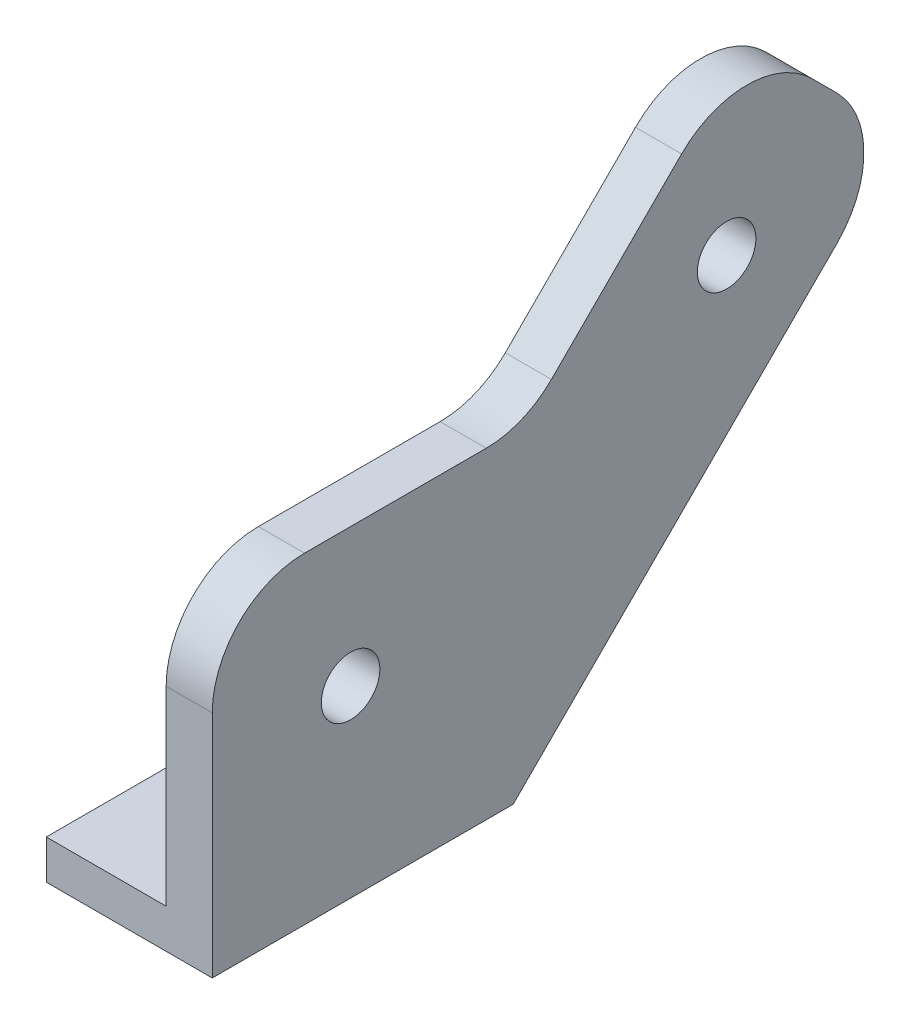
ISO-10303-21;
HEADER;
FILE_DESCRIPTION(('STEP AP214'),'2;1');
FILE_NAME('part.step','',(''),(''),'','','');
FILE_SCHEMA(('AUTOMOTIVE_DESIGN { 1 0 10303 214 1 1 1 1 }'));
ENDSEC;
DATA;
#1=APPLICATION_CONTEXT('core data for automotive mechanical design processes');
#2=APPLICATION_PROTOCOL_DEFINITION('international standard','automotive_design',2000,#1);
#3=PRODUCT_CONTEXT('',#1,'mechanical');
#4=PRODUCT('Part','Part','',(#3));
#5=PRODUCT_RELATED_PRODUCT_CATEGORY('part','',(#4));
#6=PRODUCT_DEFINITION_FORMATION('','',#4);
#7=PRODUCT_DEFINITION_CONTEXT('part definition',#1,'design');
#8=PRODUCT_DEFINITION('design','',#6,#7);
#9=PRODUCT_DEFINITION_SHAPE('','',#8);
#10=(LENGTH_UNIT() NAMED_UNIT(*) SI_UNIT(.MILLI.,.METRE.));
#11=(NAMED_UNIT(*) PLANE_ANGLE_UNIT() SI_UNIT($,.RADIAN.));
#12=(NAMED_UNIT(*) SI_UNIT($,.STERADIAN.) SOLID_ANGLE_UNIT());
#13=UNCERTAINTY_MEASURE_WITH_UNIT(LENGTH_MEASURE(1.E-05),#10,'distance_accuracy_value','');
#14=(GEOMETRIC_REPRESENTATION_CONTEXT(3) GLOBAL_UNCERTAINTY_ASSIGNED_CONTEXT((#13)) GLOBAL_UNIT_ASSIGNED_CONTEXT((#10,
#11,#12)) REPRESENTATION_CONTEXT('',''));
#15=CARTESIAN_POINT('',(0.,0.,0.));
#16=DIRECTION('',(0.,0.,1.));
#17=DIRECTION('',(1.,0.,0.));
#18=AXIS2_PLACEMENT_3D('',#15,#16,#17);
#19=CARTESIAN_POINT('',(2.,24.8987726123185,14.5151963175971));
#20=DIRECTION('',(1.,0.,0.));
#21=DIRECTION('',(0.,0.,-1.));
#22=AXIS2_PLACEMENT_3D('',#19,#20,#21);
#23=PLANE('',#22);
#24=CARTESIAN_POINT('',(2.,39.99,-31.2648036824029));
#25=DIRECTION('',(1.,0.,0.));
#26=DIRECTION('',(0.,0.,-1.));
#27=AXIS2_PLACEMENT_3D('',#24,#25,#26);
#28=CIRCLE('',#27,6.175);
#29=CARTESIAN_POINT('',(2.,39.99,-37.4398036824029));
#30=VERTEX_POINT('',#29);
#31=EDGE_CURVE('E40',#30,#30,#28,.F.);
#32=ORIENTED_EDGE('',*,*,#31,.F.);
#33=EDGE_LOOP('',(#32));
#34=FACE_BOUND('',#33,.T.);
#35=CARTESIAN_POINT('',(2.,19.93,9.51519631759709));
#36=DIRECTION('',(1.,0.,0.));
#37=DIRECTION('',(0.,0.,-1.));
#38=AXIS2_PLACEMENT_3D('',#35,#36,#37);
#39=CIRCLE('',#38,6.175);
#40=CARTESIAN_POINT('',(2.,19.93,3.34019631759709));
#41=VERTEX_POINT('',#40);
#42=EDGE_CURVE('E369',#41,#41,#39,.F.);
#43=ORIENTED_EDGE('',*,*,#42,.F.);
#44=EDGE_LOOP('',(#43));
#45=FACE_BOUND('',#44,.T.);
#46=DIRECTION('',(0.,0.,-1.));
#47=VECTOR('',#46,1.);
#48=CARTESIAN_POINT('',(2.,4.24264068711928,-8.11429462561203));
#49=LINE('',#48,#47);
#50=CARTESIAN_POINT('',(2.,4.24264068711928,21.5151963175971));
#51=VERTEX_POINT('',#50);
#52=CARTESIAN_POINT('',(2.,4.24264068711928,-8.11429462561203));
#53=VERTEX_POINT('',#52);
#54=EDGE_CURVE('E47',#51,#53,#49,.T.);
#55=ORIENTED_EDGE('',*,*,#54,.F.);
#56=DIRECTION('',(0.,-1.,0.));
#57=VECTOR('',#56,1.);
#58=CARTESIAN_POINT('',(2.,24.8987726123185,21.5151963175971));
#59=LINE('',#58,#57);
#60=CARTESIAN_POINT('',(2.,24.8987726123185,21.5151963175971));
#61=VERTEX_POINT('',#60);
#62=EDGE_CURVE('E237',#61,#51,#59,.T.);
#63=ORIENTED_EDGE('',*,*,#62,.F.);
#64=CARTESIAN_POINT('',(2.,24.8987726123185,14.5151963175971));
#65=DIRECTION('',(1.,0.,0.));
#66=DIRECTION('',(0.,0.,-1.));
#67=AXIS2_PLACEMENT_3D('',#64,#65,#66);
#68=CIRCLE('',#67,7.);
#69=CARTESIAN_POINT('',(2.,31.8987726123185,14.5151963175971));
#70=VERTEX_POINT('',#69);
#71=EDGE_CURVE('E234',#70,#61,#68,.T.);
#72=ORIENTED_EDGE('',*,*,#71,.F.);
#73=DIRECTION('',(0.,0.,1.));
#74=VECTOR('',#73,1.);
#75=CARTESIAN_POINT('',(2.,31.8987726123185,-5.19194972778158));
#76=LINE('',#75,#74);
#77=CARTESIAN_POINT('',(2.,31.8987726123185,-5.19194972778158));
#78=VERTEX_POINT('',#77);
#79=EDGE_CURVE('E253',#78,#70,#76,.T.);
#80=ORIENTED_EDGE('',*,*,#79,.F.);
#81=CARTESIAN_POINT('',(2.,44.8987726123185,-5.19194972778157));
#82=DIRECTION('',(-1.,0.,0.));
#83=DIRECTION('',(0.,0.,-1.));
#84=AXIS2_PLACEMENT_3D('',#81,#82,#83);
#85=CIRCLE('',#84,13.);
#86=CARTESIAN_POINT('',(2.,35.7063844568934,-14.3843378832067));
#87=VERTEX_POINT('',#86);
#88=EDGE_CURVE('E251',#87,#78,#85,.T.);
#89=ORIENTED_EDGE('',*,*,#88,.F.);
#90=DIRECTION('',(0.,-0.707106781186549,0.707106781186546));
#91=VECTOR('',#90,1.);
#92=CARTESIAN_POINT('',(2.,49.8239590339776,-28.5019124602908));
#93=LINE('',#92,#91);
#94=CARTESIAN_POINT('',(2.,49.8239590339776,-28.5019124602908));
#95=VERTEX_POINT('',#94);
#96=EDGE_CURVE('E249',#95,#87,#93,.T.);
#97=ORIENTED_EDGE('',*,*,#96,.F.);
#98=CARTESIAN_POINT('',(2.,44.8742115656717,-33.4516599285966));
#99=DIRECTION('',(1.,0.,0.));
#100=DIRECTION('',(0.,0.,-1.));
#101=AXIS2_PLACEMENT_3D('',#98,#99,#100);
#102=CIRCLE('',#101,7.00000000000001);
#103=CARTESIAN_POINT('',(2.,49.8239590339776,-38.4014073969024));
#104=VERTEX_POINT('',#103);
#105=EDGE_CURVE('E247',#104,#95,#102,.T.);
#106=ORIENTED_EDGE('',*,*,#105,.F.);
#107=DIRECTION('',(0.,0.707106781186547,0.707106781186548));
#108=VECTOR('',#107,1.);
#109=CARTESIAN_POINT('',(2.,47.1266037144996,-41.0987627163805));
#110=LINE('',#109,#108);
#111=CARTESIAN_POINT('',(2.,47.1266037144996,-41.0987627163805));
#112=VERTEX_POINT('',#111);
#113=EDGE_CURVE('E245',#112,#104,#110,.T.);
#114=ORIENTED_EDGE('',*,*,#113,.F.);
#115=CARTESIAN_POINT('',(2.,42.1768562461937,-36.1490152480747));
#116=DIRECTION('',(1.,0.,0.));
#117=DIRECTION('',(0.,0.,-1.));
#118=AXIS2_PLACEMENT_3D('',#115,#116,#117);
#119=CIRCLE('',#118,7.);
#120=CARTESIAN_POINT('',(2.,37.2271087778879,-41.0987627163805));
#121=VERTEX_POINT('',#120);
#122=EDGE_CURVE('E243',#121,#112,#119,.T.);
#123=ORIENTED_EDGE('',*,*,#122,.F.);
#124=DIRECTION('',(0.,0.707106781186549,-0.707106781186546));
#125=VECTOR('',#124,1.);
#126=CARTESIAN_POINT('',(2.,2.99999999999999,-6.87165393849274));
#127=LINE('',#126,#125);
#128=EDGE_CURVE('E241',#53,#121,#127,.T.);
#129=ORIENTED_EDGE('',*,*,#128,.F.);
#130=EDGE_LOOP('',(#55,#63,#72,#80,#89,#97,#106,#114,#123,#129));
#131=FACE_BOUND('',#130,.T.);
#132=ADVANCED_FACE('F32',(#34,#45,#131),#23,.F.);
#133=CARTESIAN_POINT('',(0.,24.8987726123185,14.5151963175971));
#134=DIRECTION('',(-1.,0.,0.));
#135=DIRECTION('',(0.,0.,1.));
#136=AXIS2_PLACEMENT_3D('',#133,#134,#135);
#137=PLANE('',#136);
#138=DIRECTION('',(0.,0.707106781186549,-0.707106781186546));
#139=VECTOR('',#138,1.);
#140=CARTESIAN_POINT('',(0.,35.1057884343283,-43.2200830599402));
#141=LINE('',#140,#139);
#142=CARTESIAN_POINT('',(0.,0.,-8.11429462561203));
#143=VERTEX_POINT('',#142);
#144=CARTESIAN_POINT('',(0.,35.1057884343283,-43.2200830599402));
#145=VERTEX_POINT('',#144);
#146=EDGE_CURVE('E330',#143,#145,#141,.T.);
#147=ORIENTED_EDGE('',*,*,#146,.F.);
#148=DIRECTION('',(0.,1.,0.));
#149=VECTOR('',#148,1.);
#150=CARTESIAN_POINT('',(0.,24.8987726123185,-8.11429462561203));
#151=LINE('',#150,#149);
#152=CARTESIAN_POINT('',(0.,4.24264068711928,-8.11429462561203));
#153=VERTEX_POINT('',#152);
#154=EDGE_CURVE('E208',#143,#153,#151,.T.);
#155=ORIENTED_EDGE('',*,*,#154,.T.);
#156=DIRECTION('',(0.,0.707106781186549,-0.707106781186546));
#157=VECTOR('',#156,1.);
#158=CARTESIAN_POINT('',(0.,2.99999999999999,-6.87165393849274));
#159=LINE('',#158,#157);
#160=CARTESIAN_POINT('',(0.,37.2271087778879,-41.0987627163805));
#161=VERTEX_POINT('',#160);
#162=EDGE_CURVE('E260',#153,#161,#159,.T.);
#163=ORIENTED_EDGE('',*,*,#162,.T.);
#164=CARTESIAN_POINT('',(0.,42.1768562461937,-36.1490152480747));
#165=DIRECTION('',(1.,0.,0.));
#166=DIRECTION('',(0.,0.,-1.));
#167=AXIS2_PLACEMENT_3D('',#164,#165,#166);
#168=CIRCLE('',#167,7.);
#169=CARTESIAN_POINT('',(0.,47.1266037144996,-41.0987627163805));
#170=VERTEX_POINT('',#169);
#171=EDGE_CURVE('E262',#161,#170,#168,.T.);
#172=ORIENTED_EDGE('',*,*,#171,.T.);
#173=DIRECTION('',(0.,0.707106781186547,0.707106781186548));
#174=VECTOR('',#173,1.);
#175=CARTESIAN_POINT('',(0.,47.1266037144996,-41.0987627163805));
#176=LINE('',#175,#174);
#177=CARTESIAN_POINT('',(0.,49.8239590339776,-38.4014073969024));
#178=VERTEX_POINT('',#177);
#179=EDGE_CURVE('E265',#170,#178,#176,.T.);
#180=ORIENTED_EDGE('',*,*,#179,.T.);
#181=CARTESIAN_POINT('',(0.,44.8742115656717,-33.4516599285966));
#182=DIRECTION('',(1.,0.,0.));
#183=DIRECTION('',(0.,0.,-1.));
#184=AXIS2_PLACEMENT_3D('',#181,#182,#183);
#185=CIRCLE('',#184,7.00000000000001);
#186=CARTESIAN_POINT('',(0.,49.8239590339776,-28.5019124602908));
#187=VERTEX_POINT('',#186);
#188=EDGE_CURVE('E268',#178,#187,#185,.T.);
#189=ORIENTED_EDGE('',*,*,#188,.T.);
#190=DIRECTION('',(0.,-0.707106781186549,0.707106781186546));
#191=VECTOR('',#190,1.);
#192=CARTESIAN_POINT('',(0.,49.8239590339776,-28.5019124602908));
#193=LINE('',#192,#191);
#194=CARTESIAN_POINT('',(0.,35.7063844568934,-14.3843378832067));
#195=VERTEX_POINT('',#194);
#196=EDGE_CURVE('E271',#187,#195,#193,.T.);
#197=ORIENTED_EDGE('',*,*,#196,.T.);
#198=CARTESIAN_POINT('',(0.,44.8987726123185,-5.19194972778157));
#199=DIRECTION('',(-1.,0.,0.));
#200=DIRECTION('',(0.,0.,-1.));
#201=AXIS2_PLACEMENT_3D('',#198,#199,#200);
#202=CIRCLE('',#201,13.);
#203=CARTESIAN_POINT('',(0.,31.8987726123185,-5.19194972778158));
#204=VERTEX_POINT('',#203);
#205=EDGE_CURVE('E274',#195,#204,#202,.T.);
#206=ORIENTED_EDGE('',*,*,#205,.T.);
#207=DIRECTION('',(0.,0.,1.));
#208=VECTOR('',#207,1.);
#209=CARTESIAN_POINT('',(0.,31.8987726123185,-5.19194972778158));
#210=LINE('',#209,#208);
#211=CARTESIAN_POINT('',(0.,31.8987726123185,14.5151963175971));
#212=VERTEX_POINT('',#211);
#213=EDGE_CURVE('E238',#204,#212,#210,.T.);
#214=ORIENTED_EDGE('',*,*,#213,.T.);
#215=CARTESIAN_POINT('',(0.,24.8987726123185,14.5151963175971));
#216=DIRECTION('',(1.,0.,0.));
#217=DIRECTION('',(0.,0.,-1.));
#218=AXIS2_PLACEMENT_3D('',#215,#216,#217);
#219=CIRCLE('',#218,7.);
#220=CARTESIAN_POINT('',(0.,24.8987726123185,21.5151963175971));
#221=VERTEX_POINT('',#220);
#222=EDGE_CURVE('E54',#212,#221,#219,.T.);
#223=ORIENTED_EDGE('',*,*,#222,.T.);
#224=DIRECTION('',(0.,-1.,0.));
#225=VECTOR('',#224,1.);
#226=CARTESIAN_POINT('',(0.,24.8987726123185,21.5151963175971));
#227=LINE('',#226,#225);
#228=CARTESIAN_POINT('',(0.,4.24264068711928,21.5151963175971));
#229=VERTEX_POINT('',#228);
#230=EDGE_CURVE('E257',#221,#229,#227,.T.);
#231=ORIENTED_EDGE('',*,*,#230,.T.);
#232=DIRECTION('',(0.,0.,1.));
#233=VECTOR('',#232,1.);
#234=CARTESIAN_POINT('',(0.,4.24264068711928,14.5151963175971));
#235=LINE('',#234,#233);
#236=CARTESIAN_POINT('',(0.,4.24264068711928,24.5151963175971));
#237=VERTEX_POINT('',#236);
#238=EDGE_CURVE('E213',#229,#237,#235,.T.);
#239=ORIENTED_EDGE('',*,*,#238,.T.);
#240=DIRECTION('',(0.,-1.,0.));
#241=VECTOR('',#240,1.);
#242=CARTESIAN_POINT('',(0.,0.,24.5151963175971));
#243=LINE('',#242,#241);
#244=CARTESIAN_POINT('',(0.,24.8987726123185,24.5151963175971));
#245=VERTEX_POINT('',#244);
#246=EDGE_CURVE('E327',#245,#237,#243,.T.);
#247=ORIENTED_EDGE('',*,*,#246,.F.);
#248=CARTESIAN_POINT('',(0.,24.8987726123185,14.5151963175971));
#249=DIRECTION('',(1.,0.,0.));
#250=DIRECTION('',(0.,0.,1.));
#251=AXIS2_PLACEMENT_3D('',#248,#249,#250);
#252=CIRCLE('',#251,10.);
#253=CARTESIAN_POINT('',(0.,34.8987726123186,14.5151963175971));
#254=VERTEX_POINT('',#253);
#255=EDGE_CURVE('E301',#254,#245,#252,.T.);
#256=ORIENTED_EDGE('',*,*,#255,.F.);
#257=DIRECTION('',(0.,0.,1.));
#258=VECTOR('',#257,1.);
#259=CARTESIAN_POINT('',(0.,34.8987726123186,14.5151963175971));
#260=LINE('',#259,#258);
#261=CARTESIAN_POINT('',(0.,34.8987726123186,-5.19194972778157));
#262=VERTEX_POINT('',#261);
#263=EDGE_CURVE('E306',#262,#254,#260,.T.);
#264=ORIENTED_EDGE('',*,*,#263,.F.);
#265=CARTESIAN_POINT('',(0.,44.8987726123185,-5.19194972778157));
#266=DIRECTION('',(-1.,0.,0.));
#267=DIRECTION('',(0.,0.,1.));
#268=AXIS2_PLACEMENT_3D('',#265,#266,#267);
#269=CIRCLE('',#268,10.);
#270=CARTESIAN_POINT('',(0.,37.8277048004531,-12.2630175396471));
#271=VERTEX_POINT('',#270);
#272=EDGE_CURVE('E340',#271,#262,#269,.T.);
#273=ORIENTED_EDGE('',*,*,#272,.F.);
#274=DIRECTION('',(0.,-0.707106781186549,0.707106781186546));
#275=VECTOR('',#274,1.);
#276=CARTESIAN_POINT('',(0.,37.8277048004531,-12.2630175396471));
#277=LINE('',#276,#275);
#278=CARTESIAN_POINT('',(0.,51.9452793775372,-26.3805921167311));
#279=VERTEX_POINT('',#278);
#280=EDGE_CURVE('E338',#279,#271,#277,.T.);
#281=ORIENTED_EDGE('',*,*,#280,.F.);
#282=CARTESIAN_POINT('',(0.,44.8742115656717,-33.4516599285966));
#283=DIRECTION('',(1.,0.,0.));
#284=DIRECTION('',(0.,0.,-1.));
#285=AXIS2_PLACEMENT_3D('',#282,#283,#284);
#286=CIRCLE('',#285,10.);
#287=CARTESIAN_POINT('',(0.,51.9452793775372,-40.5227277404621));
#288=VERTEX_POINT('',#287);
#289=EDGE_CURVE('E336',#288,#279,#286,.T.);
#290=ORIENTED_EDGE('',*,*,#289,.F.);
#291=DIRECTION('',(0.,0.707106781186546,0.707106781186549));
#292=VECTOR('',#291,1.);
#293=CARTESIAN_POINT('',(0.,51.9452793775372,-40.5227277404621));
#294=LINE('',#293,#292);
#295=CARTESIAN_POINT('',(0.,49.2479240580592,-43.2200830599401));
#296=VERTEX_POINT('',#295);
#297=EDGE_CURVE('E334',#296,#288,#294,.T.);
#298=ORIENTED_EDGE('',*,*,#297,.F.);
#299=CARTESIAN_POINT('',(0.,42.1768562461937,-36.1490152480747));
#300=DIRECTION('',(1.,0.,0.));
#301=DIRECTION('',(0.,0.,-1.));
#302=AXIS2_PLACEMENT_3D('',#299,#300,#301);
#303=CIRCLE('',#302,10.);
#304=EDGE_CURVE('E332',#145,#296,#303,.T.);
#305=ORIENTED_EDGE('',*,*,#304,.F.);
#306=EDGE_LOOP('',(#147,#155,#163,#172,#180,#189,#197,#206,#214,#223,#231,#239,#247,#256,#264,
#273,#281,#290,#298,#305));
#307=FACE_BOUND('',#306,.T.);
#308=ADVANCED_FACE('F378',(#307),#137,.T.);
#309=CARTESIAN_POINT('',(2.,24.8987726123185,21.5151963175971));
#310=DIRECTION('',(0.,0.,-1.));
#311=DIRECTION('',(-1.,0.,0.));
#312=AXIS2_PLACEMENT_3D('',#309,#310,#311);
#313=PLANE('',#312);
#314=ORIENTED_EDGE('',*,*,#62,.T.);
#315=DIRECTION('',(-1.,0.,0.));
#316=VECTOR('',#315,1.);
#317=CARTESIAN_POINT('',(2.,4.24264068711928,21.5151963175971));
#318=LINE('',#317,#316);
#319=EDGE_CURVE('E209',#51,#229,#318,.T.);
#320=ORIENTED_EDGE('',*,*,#319,.T.);
#321=ORIENTED_EDGE('',*,*,#230,.F.);
#322=DIRECTION('',(-1.,0.,0.));
#323=VECTOR('',#322,1.);
#324=CARTESIAN_POINT('',(2.,24.8987726123185,21.5151963175971));
#325=LINE('',#324,#323);
#326=EDGE_CURVE('E293',#61,#221,#325,.T.);
#327=ORIENTED_EDGE('',*,*,#326,.F.);
#328=EDGE_LOOP('',(#314,#320,#321,#327));
#329=FACE_BOUND('',#328,.T.);
#330=ADVANCED_FACE('F389',(#329),#313,.T.);
#331=CARTESIAN_POINT('',(2.,2.99999999999999,-6.87165393849274));
#332=DIRECTION('',(0.,0.707106781186546,0.707106781186549));
#333=DIRECTION('',(0.,-0.707106781186549,0.707106781186546));
#334=AXIS2_PLACEMENT_3D('',#331,#332,#333);
#335=PLANE('',#334);
#336=ORIENTED_EDGE('',*,*,#162,.F.);
#337=DIRECTION('',(1.,0.,0.));
#338=VECTOR('',#337,1.);
#339=CARTESIAN_POINT('',(2.,4.24264068711928,-8.11429462561203));
#340=LINE('',#339,#338);
#341=EDGE_CURVE('E11',#153,#53,#340,.T.);
#342=ORIENTED_EDGE('',*,*,#341,.T.);
#343=ORIENTED_EDGE('',*,*,#128,.T.);
#344=DIRECTION('',(-1.,0.,0.));
#345=VECTOR('',#344,1.);
#346=CARTESIAN_POINT('',(2.,37.2271087778879,-41.0987627163805));
#347=LINE('',#346,#345);
#348=EDGE_CURVE('E290',#121,#161,#347,.T.);
#349=ORIENTED_EDGE('',*,*,#348,.T.);
#350=EDGE_LOOP('',(#336,#342,#343,#349));
#351=FACE_BOUND('',#350,.T.);
#352=ADVANCED_FACE('F423',(#351),#335,.T.);
#353=CARTESIAN_POINT('',(5.,24.8987726123185,14.5151963175971));
#354=DIRECTION('',(-1.,0.,0.));
#355=DIRECTION('',(0.,0.,1.));
#356=AXIS2_PLACEMENT_3D('',#353,#354,#355);
#357=PLANE('',#356);
#358=CARTESIAN_POINT('',(5.,39.99,-31.2648036824029));
#359=DIRECTION('',(1.,0.,0.));
#360=DIRECTION('',(0.,0.,-1.));
#361=AXIS2_PLACEMENT_3D('',#358,#359,#360);
#362=CIRCLE('',#361,3.175);
#363=CARTESIAN_POINT('',(5.,39.99,-34.4398036824029));
#364=VERTEX_POINT('',#363);
#365=EDGE_CURVE('E298',#364,#364,#362,.T.);
#366=ORIENTED_EDGE('',*,*,#365,.F.);
#367=EDGE_LOOP('',(#366));
#368=FACE_BOUND('',#367,.T.);
#369=CARTESIAN_POINT('',(5.,24.8987726123185,14.5151963175971));
#370=DIRECTION('',(1.,0.,0.));
#371=DIRECTION('',(0.,0.,1.));
#372=AXIS2_PLACEMENT_3D('',#369,#370,#371);
#373=CIRCLE('',#372,10.);
#374=CARTESIAN_POINT('',(5.,34.8987726123186,14.5151963175971));
#375=VERTEX_POINT('',#374);
#376=CARTESIAN_POINT('',(5.,24.8987726123185,24.5151963175971));
#377=VERTEX_POINT('',#376);
#378=EDGE_CURVE('E302',#375,#377,#373,.T.);
#379=ORIENTED_EDGE('',*,*,#378,.T.);
#380=DIRECTION('',(0.,-1.,0.));
#381=VECTOR('',#380,1.);
#382=CARTESIAN_POINT('',(5.,0.,24.5151963175971));
#383=LINE('',#382,#381);
#384=CARTESIAN_POINT('',(5.,0.,24.5151963175971));
#385=VERTEX_POINT('',#384);
#386=EDGE_CURVE('E305',#377,#385,#383,.T.);
#387=ORIENTED_EDGE('',*,*,#386,.T.);
#388=DIRECTION('',(0.,0.,-1.));
#389=VECTOR('',#388,1.);
#390=CARTESIAN_POINT('',(5.,0.,-8.11429462561203));
#391=LINE('',#390,#389);
#392=CARTESIAN_POINT('',(5.,0.,-8.11429462561203));
#393=VERTEX_POINT('',#392);
#394=EDGE_CURVE('E308',#385,#393,#391,.T.);
#395=ORIENTED_EDGE('',*,*,#394,.T.);
#396=DIRECTION('',(0.,0.707106781186549,-0.707106781186546));
#397=VECTOR('',#396,1.);
#398=CARTESIAN_POINT('',(5.,35.1057884343283,-43.2200830599402));
#399=LINE('',#398,#397);
#400=CARTESIAN_POINT('',(5.,35.1057884343283,-43.2200830599402));
#401=VERTEX_POINT('',#400);
#402=EDGE_CURVE('E310',#393,#401,#399,.T.);
#403=ORIENTED_EDGE('',*,*,#402,.T.);
#404=CARTESIAN_POINT('',(5.,42.1768562461937,-36.1490152480747));
#405=DIRECTION('',(1.,0.,0.));
#406=DIRECTION('',(0.,0.,-1.));
#407=AXIS2_PLACEMENT_3D('',#404,#405,#406);
#408=CIRCLE('',#407,10.);
#409=CARTESIAN_POINT('',(5.,49.2479240580592,-43.2200830599401));
#410=VERTEX_POINT('',#409);
#411=EDGE_CURVE('E312',#401,#410,#408,.T.);
#412=ORIENTED_EDGE('',*,*,#411,.T.);
#413=DIRECTION('',(0.,0.707106781186546,0.707106781186549));
#414=VECTOR('',#413,1.);
#415=CARTESIAN_POINT('',(5.,51.9452793775372,-40.5227277404621));
#416=LINE('',#415,#414);
#417=CARTESIAN_POINT('',(5.,51.9452793775372,-40.5227277404621));
#418=VERTEX_POINT('',#417);
#419=EDGE_CURVE('E314',#410,#418,#416,.T.);
#420=ORIENTED_EDGE('',*,*,#419,.T.);
#421=CARTESIAN_POINT('',(5.,44.8742115656717,-33.4516599285966));
#422=DIRECTION('',(1.,0.,0.));
#423=DIRECTION('',(0.,0.,-1.));
#424=AXIS2_PLACEMENT_3D('',#421,#422,#423);
#425=CIRCLE('',#424,10.);
#426=CARTESIAN_POINT('',(5.,51.9452793775372,-26.3805921167311));
#427=VERTEX_POINT('',#426);
#428=EDGE_CURVE('E316',#418,#427,#425,.T.);
#429=ORIENTED_EDGE('',*,*,#428,.T.);
#430=DIRECTION('',(0.,-0.707106781186549,0.707106781186546));
#431=VECTOR('',#430,1.);
#432=CARTESIAN_POINT('',(5.,37.8277048004531,-12.2630175396471));
#433=LINE('',#432,#431);
#434=CARTESIAN_POINT('',(5.,37.8277048004531,-12.2630175396471));
#435=VERTEX_POINT('',#434);
#436=EDGE_CURVE('E318',#427,#435,#433,.T.);
#437=ORIENTED_EDGE('',*,*,#436,.T.);
#438=CARTESIAN_POINT('',(5.,44.8987726123185,-5.19194972778157));
#439=DIRECTION('',(-1.,0.,0.));
#440=DIRECTION('',(0.,0.,1.));
#441=AXIS2_PLACEMENT_3D('',#438,#439,#440);
#442=CIRCLE('',#441,10.);
#443=CARTESIAN_POINT('',(5.,34.8987726123186,-5.19194972778157));
#444=VERTEX_POINT('',#443);
#445=EDGE_CURVE('E320',#435,#444,#442,.T.);
#446=ORIENTED_EDGE('',*,*,#445,.T.);
#447=DIRECTION('',(0.,0.,1.));
#448=VECTOR('',#447,1.);
#449=CARTESIAN_POINT('',(5.,34.8987726123186,14.5151963175971));
#450=LINE('',#449,#448);
#451=EDGE_CURVE('E322',#444,#375,#450,.T.);
#452=ORIENTED_EDGE('',*,*,#451,.T.);
#453=EDGE_LOOP('',(#379,#387,#395,#403,#412,#420,#429,#437,#446,#452));
#454=FACE_BOUND('',#453,.T.);
#455=CARTESIAN_POINT('',(5.,19.93,9.51519631759709));
#456=DIRECTION('',(1.,0.,0.));
#457=DIRECTION('',(0.,0.,-1.));
#458=AXIS2_PLACEMENT_3D('',#455,#456,#457);
#459=CIRCLE('',#458,3.175);
#460=CARTESIAN_POINT('',(5.,19.93,6.34019631759709));
#461=VERTEX_POINT('',#460);
#462=EDGE_CURVE('E295',#461,#461,#459,.T.);
#463=ORIENTED_EDGE('',*,*,#462,.F.);
#464=EDGE_LOOP('',(#463));
#465=FACE_BOUND('',#464,.T.);
#466=ADVANCED_FACE('F437',(#368,#454,#465),#357,.F.);
#467=CARTESIAN_POINT('',(5.,24.8987726123185,14.5151963175971));
#468=DIRECTION('',(-1.,0.,0.));
#469=DIRECTION('',(0.,0.,1.));
#470=AXIS2_PLACEMENT_3D('',#467,#468,#469);
#471=CYLINDRICAL_SURFACE('',#470,10.);
#472=ORIENTED_EDGE('',*,*,#255,.T.);
#473=DIRECTION('',(-1.,0.,0.));
#474=VECTOR('',#473,1.);
#475=CARTESIAN_POINT('',(5.,24.8987726123185,24.5151963175971));
#476=LINE('',#475,#474);
#477=EDGE_CURVE('E366',#377,#245,#476,.T.);
#478=ORIENTED_EDGE('',*,*,#477,.F.);
#479=ORIENTED_EDGE('',*,*,#378,.F.);
#480=DIRECTION('',(-1.,0.,0.));
#481=VECTOR('',#480,1.);
#482=CARTESIAN_POINT('',(5.,34.8987726123186,14.5151963175971));
#483=LINE('',#482,#481);
#484=EDGE_CURVE('E324',#375,#254,#483,.T.);
#485=ORIENTED_EDGE('',*,*,#484,.T.);
#486=EDGE_LOOP('',(#472,#478,#479,#485));
#487=FACE_BOUND('',#486,.T.);
#488=ADVANCED_FACE('F34',(#487),#471,.T.);
#489=CARTESIAN_POINT('',(5.,0.,24.5151963175971));
#490=DIRECTION('',(0.,0.,-1.));
#491=DIRECTION('',(-1.,0.,0.));
#492=AXIS2_PLACEMENT_3D('',#489,#490,#491);
#493=PLANE('',#492);
#494=ORIENTED_EDGE('',*,*,#246,.T.);
#495=DIRECTION('',(1.,0.,0.));
#496=VECTOR('',#495,1.);
#497=CARTESIAN_POINT('',(-13.,4.24264068711928,24.5151963175971));
#498=LINE('',#497,#496);
#499=CARTESIAN_POINT('',(-13.,4.24264068711928,24.5151963175971));
#500=VERTEX_POINT('',#499);
#501=EDGE_CURVE('E210',#500,#237,#498,.T.);
#502=ORIENTED_EDGE('',*,*,#501,.F.);
#503=DIRECTION('',(0.,1.,0.));
#504=VECTOR('',#503,1.);
#505=CARTESIAN_POINT('',(-13.,0.,24.5151963175971));
#506=LINE('',#505,#504);
#507=CARTESIAN_POINT('',(-13.,0.,24.5151963175971));
#508=VERTEX_POINT('',#507);
#509=EDGE_CURVE('E194',#508,#500,#506,.T.);
#510=ORIENTED_EDGE('',*,*,#509,.F.);
#511=DIRECTION('',(-1.,0.,0.));
#512=VECTOR('',#511,1.);
#513=CARTESIAN_POINT('',(5.,0.,24.5151963175971));
#514=LINE('',#513,#512);
#515=EDGE_CURVE('E191',#385,#508,#514,.T.);
#516=ORIENTED_EDGE('',*,*,#515,.F.);
#517=ORIENTED_EDGE('',*,*,#386,.F.);
#518=ORIENTED_EDGE('',*,*,#477,.T.);
#519=EDGE_LOOP('',(#494,#502,#510,#516,#517,#518));
#520=FACE_BOUND('',#519,.T.);
#521=ADVANCED_FACE('F443',(#520),#493,.F.);
#522=CARTESIAN_POINT('',(5.,0.,-8.11429462561203));
#523=DIRECTION('',(0.,1.,0.));
#524=DIRECTION('',(0.,0.,1.));
#525=AXIS2_PLACEMENT_3D('',#522,#523,#524);
#526=PLANE('',#525);
#527=CARTESIAN_POINT('',(-6.5,0.,8.20045084599253));
#528=DIRECTION('',(0.,1.,0.));
#529=DIRECTION('',(0.,0.,1.));
#530=AXIS2_PLACEMENT_3D('',#527,#528,#529);
#531=CIRCLE('',#530,1.7);
#532=CARTESIAN_POINT('',(-6.5,0.,9.90045084599252));
#533=VERTEX_POINT('',#532);
#534=EDGE_CURVE('E385',#533,#533,#531,.T.);
#535=ORIENTED_EDGE('',*,*,#534,.T.);
#536=EDGE_LOOP('',(#535));
#537=FACE_BOUND('',#536,.T.);
#538=ORIENTED_EDGE('',*,*,#515,.T.);
#539=DIRECTION('',(0.,0.,1.));
#540=VECTOR('',#539,1.);
#541=CARTESIAN_POINT('',(-13.,0.,-8.11429462561203));
#542=LINE('',#541,#540);
#543=CARTESIAN_POINT('',(-13.,0.,-8.11429462561203));
#544=VERTEX_POINT('',#543);
#545=EDGE_CURVE('E182',#544,#508,#542,.T.);
#546=ORIENTED_EDGE('',*,*,#545,.F.);
#547=DIRECTION('',(1.,0.,0.));
#548=VECTOR('',#547,1.);
#549=CARTESIAN_POINT('',(-13.,0.,-8.11429462561203));
#550=LINE('',#549,#548);
#551=EDGE_CURVE('E187',#544,#143,#550,.T.);
#552=ORIENTED_EDGE('',*,*,#551,.T.);
#553=DIRECTION('',(-1.,0.,0.));
#554=VECTOR('',#553,1.);
#555=CARTESIAN_POINT('',(5.,0.,-8.11429462561203));
#556=LINE('',#555,#554);
#557=EDGE_CURVE('E363',#393,#143,#556,.T.);
#558=ORIENTED_EDGE('',*,*,#557,.F.);
#559=ORIENTED_EDGE('',*,*,#394,.F.);
#560=EDGE_LOOP('',(#538,#546,#552,#558,#559));
#561=FACE_BOUND('',#560,.T.);
#562=ADVANCED_FACE('F184',(#537,#561),#526,.F.);
#563=CARTESIAN_POINT('',(5.,35.1057884343283,-43.2200830599402));
#564=DIRECTION('',(0.,0.707106781186546,0.707106781186549));
#565=DIRECTION('',(0.,-0.707106781186549,0.707106781186546));
#566=AXIS2_PLACEMENT_3D('',#563,#564,#565);
#567=PLANE('',#566);
#568=ORIENTED_EDGE('',*,*,#146,.T.);
#569=DIRECTION('',(-1.,0.,0.));
#570=VECTOR('',#569,1.);
#571=CARTESIAN_POINT('',(5.,35.1057884343283,-43.2200830599402));
#572=LINE('',#571,#570);
#573=EDGE_CURVE('E360',#401,#145,#572,.T.);
#574=ORIENTED_EDGE('',*,*,#573,.F.);
#575=ORIENTED_EDGE('',*,*,#402,.F.);
#576=ORIENTED_EDGE('',*,*,#557,.T.);
#577=EDGE_LOOP('',(#568,#574,#575,#576));
#578=FACE_BOUND('',#577,.T.);
#579=ADVANCED_FACE('F429',(#578),#567,.F.);
#580=CARTESIAN_POINT('',(5.,42.1768562461937,-36.1490152480747));
#581=DIRECTION('',(-1.,0.,0.));
#582=DIRECTION('',(0.,0.,1.));
#583=AXIS2_PLACEMENT_3D('',#580,#581,#582);
#584=CYLINDRICAL_SURFACE('',#583,10.);
#585=ORIENTED_EDGE('',*,*,#304,.T.);
#586=DIRECTION('',(-1.,0.,0.));
#587=VECTOR('',#586,1.);
#588=CARTESIAN_POINT('',(5.,49.2479240580592,-43.2200830599401));
#589=LINE('',#588,#587);
#590=EDGE_CURVE('E357',#410,#296,#589,.T.);
#591=ORIENTED_EDGE('',*,*,#590,.F.);
#592=ORIENTED_EDGE('',*,*,#411,.F.);
#593=ORIENTED_EDGE('',*,*,#573,.T.);
#594=EDGE_LOOP('',(#585,#591,#592,#593));
#595=FACE_BOUND('',#594,.T.);
#596=ADVANCED_FACE('F433',(#595),#584,.T.);
#597=CARTESIAN_POINT('',(5.,51.9452793775372,-40.5227277404621));
#598=DIRECTION('',(0.,-0.707106781186549,0.707106781186546));
#599=DIRECTION('',(0.,-0.707106781186546,-0.707106781186549));
#600=AXIS2_PLACEMENT_3D('',#597,#598,#599);
#601=PLANE('',#600);
#602=ORIENTED_EDGE('',*,*,#297,.T.);
#603=DIRECTION('',(-1.,0.,0.));
#604=VECTOR('',#603,1.);
#605=CARTESIAN_POINT('',(5.,51.9452793775372,-40.5227277404621));
#606=LINE('',#605,#604);
#607=EDGE_CURVE('E354',#418,#288,#606,.T.);
#608=ORIENTED_EDGE('',*,*,#607,.F.);
#609=ORIENTED_EDGE('',*,*,#419,.F.);
#610=ORIENTED_EDGE('',*,*,#590,.T.);
#611=EDGE_LOOP('',(#602,#608,#609,#610));
#612=FACE_BOUND('',#611,.T.);
#613=ADVANCED_FACE('F531',(#612),#601,.F.);
#614=CARTESIAN_POINT('',(5.,44.8742115656717,-33.4516599285966));
#615=DIRECTION('',(-1.,0.,0.));
#616=DIRECTION('',(0.,0.,1.));
#617=AXIS2_PLACEMENT_3D('',#614,#615,#616);
#618=CYLINDRICAL_SURFACE('',#617,10.);
#619=ORIENTED_EDGE('',*,*,#289,.T.);
#620=DIRECTION('',(-1.,0.,0.));
#621=VECTOR('',#620,1.);
#622=CARTESIAN_POINT('',(5.,51.9452793775372,-26.3805921167311));
#623=LINE('',#622,#621);
#624=EDGE_CURVE('E351',#427,#279,#623,.T.);
#625=ORIENTED_EDGE('',*,*,#624,.F.);
#626=ORIENTED_EDGE('',*,*,#428,.F.);
#627=ORIENTED_EDGE('',*,*,#607,.T.);
#628=EDGE_LOOP('',(#619,#625,#626,#627));
#629=FACE_BOUND('',#628,.T.);
#630=ADVANCED_FACE('F527',(#629),#618,.T.);
#631=CARTESIAN_POINT('',(5.,37.8277048004531,-12.2630175396471));
#632=DIRECTION('',(0.,-0.707106781186546,-0.707106781186549));
#633=DIRECTION('',(0.,0.707106781186549,-0.707106781186546));
#634=AXIS2_PLACEMENT_3D('',#631,#632,#633);
#635=PLANE('',#634);
#636=ORIENTED_EDGE('',*,*,#280,.T.);
#637=DIRECTION('',(-1.,0.,0.));
#638=VECTOR('',#637,1.);
#639=CARTESIAN_POINT('',(5.,37.8277048004531,-12.2630175396471));
#640=LINE('',#639,#638);
#641=EDGE_CURVE('E348',#435,#271,#640,.T.);
#642=ORIENTED_EDGE('',*,*,#641,.F.);
#643=ORIENTED_EDGE('',*,*,#436,.F.);
#644=ORIENTED_EDGE('',*,*,#624,.T.);
#645=EDGE_LOOP('',(#636,#642,#643,#644));
#646=FACE_BOUND('',#645,.T.);
#647=ADVANCED_FACE('F523',(#646),#635,.F.);
#648=CARTESIAN_POINT('',(5.,44.8987726123185,-5.19194972778157));
#649=DIRECTION('',(-1.,0.,0.));
#650=DIRECTION('',(0.,0.,1.));
#651=AXIS2_PLACEMENT_3D('',#648,#649,#650);
#652=CYLINDRICAL_SURFACE('',#651,10.);
#653=ORIENTED_EDGE('',*,*,#272,.T.);
#654=DIRECTION('',(-1.,0.,0.));
#655=VECTOR('',#654,1.);
#656=CARTESIAN_POINT('',(5.,34.8987726123186,-5.19194972778157));
#657=LINE('',#656,#655);
#658=EDGE_CURVE('E345',#444,#262,#657,.T.);
#659=ORIENTED_EDGE('',*,*,#658,.F.);
#660=ORIENTED_EDGE('',*,*,#445,.F.);
#661=ORIENTED_EDGE('',*,*,#641,.T.);
#662=EDGE_LOOP('',(#653,#659,#660,#661));
#663=FACE_BOUND('',#662,.T.);
#664=ADVANCED_FACE('F519',(#663),#652,.F.);
#665=CARTESIAN_POINT('',(5.,34.8987726123186,14.5151963175971));
#666=DIRECTION('',(0.,-1.,0.));
#667=DIRECTION('',(0.,0.,-1.));
#668=AXIS2_PLACEMENT_3D('',#665,#666,#667);
#669=PLANE('',#668);
#670=ORIENTED_EDGE('',*,*,#263,.T.);
#671=ORIENTED_EDGE('',*,*,#484,.F.);
#672=ORIENTED_EDGE('',*,*,#451,.F.);
#673=ORIENTED_EDGE('',*,*,#658,.T.);
#674=EDGE_LOOP('',(#670,#671,#672,#673));
#675=FACE_BOUND('',#674,.T.);
#676=ADVANCED_FACE('F510',(#675),#669,.F.);
#677=CARTESIAN_POINT('',(5.,39.99,-31.2648036824029));
#678=DIRECTION('',(-1.,0.,0.));
#679=DIRECTION('',(0.,0.,1.));
#680=AXIS2_PLACEMENT_3D('',#677,#678,#679);
#681=CYLINDRICAL_SURFACE('',#680,3.175);
#682=ORIENTED_EDGE('',*,*,#365,.T.);
#683=EDGE_LOOP('',(#682));
#684=FACE_BOUND('',#683,.T.);
#685=CARTESIAN_POINT('',(-3.,39.99,-31.2648036824029));
#686=DIRECTION('',(-1.,0.,0.));
#687=DIRECTION('',(0.,0.,1.));
#688=AXIS2_PLACEMENT_3D('',#685,#686,#687);
#689=CIRCLE('',#688,3.175);
#690=CARTESIAN_POINT('',(-3.,39.99,-28.0898036824029));
#691=VERTEX_POINT('',#690);
#692=EDGE_CURVE('E225',#691,#691,#689,.T.);
#693=ORIENTED_EDGE('',*,*,#692,.T.);
#694=EDGE_LOOP('',(#693));
#695=FACE_BOUND('',#694,.T.);
#696=ADVANCED_FACE('F506',(#684,#695),#681,.F.);
#697=CARTESIAN_POINT('',(5.,19.93,9.51519631759709));
#698=DIRECTION('',(-1.,0.,0.));
#699=DIRECTION('',(0.,0.,1.));
#700=AXIS2_PLACEMENT_3D('',#697,#698,#699);
#701=CYLINDRICAL_SURFACE('',#700,3.175);
#702=ORIENTED_EDGE('',*,*,#462,.T.);
#703=EDGE_LOOP('',(#702));
#704=FACE_BOUND('',#703,.T.);
#705=CARTESIAN_POINT('',(-3.,19.93,9.51519631759709));
#706=DIRECTION('',(-1.,0.,0.));
#707=DIRECTION('',(0.,0.,1.));
#708=AXIS2_PLACEMENT_3D('',#705,#706,#707);
#709=CIRCLE('',#708,3.175);
#710=CARTESIAN_POINT('',(-3.,19.93,12.6901963175971));
#711=VERTEX_POINT('',#710);
#712=EDGE_CURVE('E222',#711,#711,#709,.T.);
#713=ORIENTED_EDGE('',*,*,#712,.T.);
#714=EDGE_LOOP('',(#713));
#715=FACE_BOUND('',#714,.T.);
#716=ADVANCED_FACE('F503',(#704,#715),#701,.F.);
#717=CARTESIAN_POINT('',(2.,24.8987726123185,14.5151963175971));
#718=DIRECTION('',(-1.,0.,0.));
#719=DIRECTION('',(0.,0.,1.));
#720=AXIS2_PLACEMENT_3D('',#717,#718,#719);
#721=CYLINDRICAL_SURFACE('',#720,7.);
#722=ORIENTED_EDGE('',*,*,#222,.F.);
#723=DIRECTION('',(-1.,0.,0.));
#724=VECTOR('',#723,1.);
#725=CARTESIAN_POINT('',(2.,31.8987726123185,14.5151963175971));
#726=LINE('',#725,#724);
#727=EDGE_CURVE('E255',#70,#212,#726,.T.);
#728=ORIENTED_EDGE('',*,*,#727,.F.);
#729=ORIENTED_EDGE('',*,*,#71,.T.);
#730=ORIENTED_EDGE('',*,*,#326,.T.);
#731=EDGE_LOOP('',(#722,#728,#729,#730));
#732=FACE_BOUND('',#731,.T.);
#733=ADVANCED_FACE('F390',(#732),#721,.F.);
#734=CARTESIAN_POINT('',(2.,42.1768562461937,-36.1490152480747));
#735=DIRECTION('',(-1.,0.,0.));
#736=DIRECTION('',(0.,0.,1.));
#737=AXIS2_PLACEMENT_3D('',#734,#735,#736);
#738=CYLINDRICAL_SURFACE('',#737,7.);
#739=ORIENTED_EDGE('',*,*,#171,.F.);
#740=ORIENTED_EDGE('',*,*,#348,.F.);
#741=ORIENTED_EDGE('',*,*,#122,.T.);
#742=DIRECTION('',(-1.,0.,0.));
#743=VECTOR('',#742,1.);
#744=CARTESIAN_POINT('',(2.,47.1266037144996,-41.0987627163805));
#745=LINE('',#744,#743);
#746=EDGE_CURVE('E288',#112,#170,#745,.T.);
#747=ORIENTED_EDGE('',*,*,#746,.T.);
#748=EDGE_LOOP('',(#739,#740,#741,#747));
#749=FACE_BOUND('',#748,.T.);
#750=ADVANCED_FACE('F419',(#749),#738,.F.);
#751=CARTESIAN_POINT('',(2.,47.1266037144996,-41.0987627163805));
#752=DIRECTION('',(0.,-0.707106781186549,0.707106781186547));
#753=DIRECTION('',(0.,-0.707106781186547,-0.707106781186549));
#754=AXIS2_PLACEMENT_3D('',#751,#752,#753);
#755=PLANE('',#754);
#756=ORIENTED_EDGE('',*,*,#179,.F.);
#757=ORIENTED_EDGE('',*,*,#746,.F.);
#758=ORIENTED_EDGE('',*,*,#113,.T.);
#759=DIRECTION('',(-1.,0.,0.));
#760=VECTOR('',#759,1.);
#761=CARTESIAN_POINT('',(2.,49.8239590339776,-38.4014073969024));
#762=LINE('',#761,#760);
#763=EDGE_CURVE('E286',#104,#178,#762,.T.);
#764=ORIENTED_EDGE('',*,*,#763,.T.);
#765=EDGE_LOOP('',(#756,#757,#758,#764));
#766=FACE_BOUND('',#765,.T.);
#767=ADVANCED_FACE('F416',(#766),#755,.T.);
#768=CARTESIAN_POINT('',(2.,44.8742115656717,-33.4516599285966));
#769=DIRECTION('',(-1.,0.,0.));
#770=DIRECTION('',(0.,0.,1.));
#771=AXIS2_PLACEMENT_3D('',#768,#769,#770);
#772=CYLINDRICAL_SURFACE('',#771,7.00000000000001);
#773=ORIENTED_EDGE('',*,*,#188,.F.);
#774=ORIENTED_EDGE('',*,*,#763,.F.);
#775=ORIENTED_EDGE('',*,*,#105,.T.);
#776=DIRECTION('',(-1.,0.,0.));
#777=VECTOR('',#776,1.);
#778=CARTESIAN_POINT('',(2.,49.8239590339776,-28.5019124602908));
#779=LINE('',#778,#777);
#780=EDGE_CURVE('E284',#95,#187,#779,.T.);
#781=ORIENTED_EDGE('',*,*,#780,.T.);
#782=EDGE_LOOP('',(#773,#774,#775,#781));
#783=FACE_BOUND('',#782,.T.);
#784=ADVANCED_FACE('F410',(#783),#772,.F.);
#785=CARTESIAN_POINT('',(2.,49.8239590339776,-28.5019124602908));
#786=DIRECTION('',(0.,-0.707106781186546,-0.707106781186549));
#787=DIRECTION('',(0.,0.707106781186549,-0.707106781186546));
#788=AXIS2_PLACEMENT_3D('',#785,#786,#787);
#789=PLANE('',#788);
#790=ORIENTED_EDGE('',*,*,#196,.F.);
#791=ORIENTED_EDGE('',*,*,#780,.F.);
#792=ORIENTED_EDGE('',*,*,#96,.T.);
#793=DIRECTION('',(-1.,0.,0.));
#794=VECTOR('',#793,1.);
#795=CARTESIAN_POINT('',(2.,35.7063844568934,-14.3843378832067));
#796=LINE('',#795,#794);
#797=EDGE_CURVE('E282',#87,#195,#796,.T.);
#798=ORIENTED_EDGE('',*,*,#797,.T.);
#799=EDGE_LOOP('',(#790,#791,#792,#798));
#800=FACE_BOUND('',#799,.T.);
#801=ADVANCED_FACE('F406',(#800),#789,.T.);
#802=CARTESIAN_POINT('',(2.,44.8987726123185,-5.19194972778157));
#803=DIRECTION('',(-1.,0.,0.));
#804=DIRECTION('',(0.,0.,1.));
#805=AXIS2_PLACEMENT_3D('',#802,#803,#804);
#806=CYLINDRICAL_SURFACE('',#805,13.);
#807=ORIENTED_EDGE('',*,*,#205,.F.);
#808=ORIENTED_EDGE('',*,*,#797,.F.);
#809=ORIENTED_EDGE('',*,*,#88,.T.);
#810=DIRECTION('',(-1.,0.,0.));
#811=VECTOR('',#810,1.);
#812=CARTESIAN_POINT('',(2.,31.8987726123185,-5.19194972778158));
#813=LINE('',#812,#811);
#814=EDGE_CURVE('E280',#78,#204,#813,.T.);
#815=ORIENTED_EDGE('',*,*,#814,.T.);
#816=EDGE_LOOP('',(#807,#808,#809,#815));
#817=FACE_BOUND('',#816,.T.);
#818=ADVANCED_FACE('F403',(#817),#806,.T.);
#819=CARTESIAN_POINT('',(2.,31.8987726123185,-5.19194972778158));
#820=DIRECTION('',(0.,-1.,0.));
#821=DIRECTION('',(0.,0.,-1.));
#822=AXIS2_PLACEMENT_3D('',#819,#820,#821);
#823=PLANE('',#822);
#824=ORIENTED_EDGE('',*,*,#213,.F.);
#825=ORIENTED_EDGE('',*,*,#814,.F.);
#826=ORIENTED_EDGE('',*,*,#79,.T.);
#827=ORIENTED_EDGE('',*,*,#727,.T.);
#828=EDGE_LOOP('',(#824,#825,#826,#827));
#829=FACE_BOUND('',#828,.T.);
#830=ADVANCED_FACE('F396',(#829),#823,.T.);
#831=CARTESIAN_POINT('',(-3.,19.93,9.51519631759709));
#832=DIRECTION('',(-1.,0.,0.));
#833=DIRECTION('',(0.,0.,1.));
#834=AXIS2_PLACEMENT_3D('',#831,#832,#833);
#835=PLANE('',#834);
#836=ORIENTED_EDGE('',*,*,#712,.F.);
#837=EDGE_LOOP('',(#836));
#838=FACE_BOUND('',#837,.T.);
#839=CARTESIAN_POINT('',(-3.,19.93,9.51519631759709));
#840=DIRECTION('',(-1.,0.,0.));
#841=DIRECTION('',(0.,0.,1.));
#842=AXIS2_PLACEMENT_3D('',#839,#840,#841);
#843=CIRCLE('',#842,6.175);
#844=CARTESIAN_POINT('',(-3.,19.93,15.6901963175971));
#845=VERTEX_POINT('',#844);
#846=EDGE_CURVE('E231',#845,#845,#843,.T.);
#847=ORIENTED_EDGE('',*,*,#846,.T.);
#848=EDGE_LOOP('',(#847));
#849=FACE_BOUND('',#848,.T.);
#850=ADVANCED_FACE('F478',(#838,#849),#835,.T.);
#851=CARTESIAN_POINT('',(-3.,19.93,9.51519631759709));
#852=DIRECTION('',(1.,0.,0.));
#853=DIRECTION('',(0.,0.,-1.));
#854=AXIS2_PLACEMENT_3D('',#851,#852,#853);
#855=CYLINDRICAL_SURFACE('',#854,6.175);
#856=ORIENTED_EDGE('',*,*,#846,.F.);
#857=EDGE_LOOP('',(#856));
#858=FACE_BOUND('',#857,.T.);
#859=ORIENTED_EDGE('',*,*,#42,.T.);
#860=EDGE_LOOP('',(#859));
#861=FACE_BOUND('',#860,.T.);
#862=ADVANCED_FACE('F476',(#858,#861),#855,.T.);
#863=CARTESIAN_POINT('',(-3.,39.99,-31.2648036824029));
#864=DIRECTION('',(1.,0.,0.));
#865=DIRECTION('',(0.,0.,-1.));
#866=AXIS2_PLACEMENT_3D('',#863,#864,#865);
#867=CYLINDRICAL_SURFACE('',#866,6.175);
#868=CARTESIAN_POINT('',(-3.,39.99,-31.2648036824029));
#869=DIRECTION('',(-1.,0.,0.));
#870=DIRECTION('',(0.,0.,1.));
#871=AXIS2_PLACEMENT_3D('',#868,#869,#870);
#872=CIRCLE('',#871,6.175);
#873=CARTESIAN_POINT('',(-3.,39.99,-25.0898036824029));
#874=VERTEX_POINT('',#873);
#875=EDGE_CURVE('E228',#874,#874,#872,.T.);
#876=ORIENTED_EDGE('',*,*,#875,.F.);
#877=EDGE_LOOP('',(#876));
#878=FACE_BOUND('',#877,.T.);
#879=ORIENTED_EDGE('',*,*,#31,.T.);
#880=EDGE_LOOP('',(#879));
#881=FACE_BOUND('',#880,.T.);
#882=ADVANCED_FACE('F374',(#878,#881),#867,.T.);
#883=CARTESIAN_POINT('',(-3.,39.99,-31.2648036824029));
#884=DIRECTION('',(-1.,0.,0.));
#885=DIRECTION('',(0.,0.,1.));
#886=AXIS2_PLACEMENT_3D('',#883,#884,#885);
#887=PLANE('',#886);
#888=ORIENTED_EDGE('',*,*,#692,.F.);
#889=EDGE_LOOP('',(#888));
#890=FACE_BOUND('',#889,.T.);
#891=ORIENTED_EDGE('',*,*,#875,.T.);
#892=EDGE_LOOP('',(#891));
#893=FACE_BOUND('',#892,.T.);
#894=ADVANCED_FACE('F467',(#890,#893),#887,.T.);
#895=CARTESIAN_POINT('',(-13.,0.,-8.11429462561203));
#896=DIRECTION('',(0.,0.,1.));
#897=DIRECTION('',(1.,0.,0.));
#898=AXIS2_PLACEMENT_3D('',#895,#896,#897);
#899=PLANE('',#898);
#900=ORIENTED_EDGE('',*,*,#154,.F.);
#901=ORIENTED_EDGE('',*,*,#551,.F.);
#902=DIRECTION('',(0.,-1.,0.));
#903=VECTOR('',#902,1.);
#904=CARTESIAN_POINT('',(-13.,0.,-8.11429462561203));
#905=LINE('',#904,#903);
#906=CARTESIAN_POINT('',(-13.,4.24264068711928,-8.11429462561203));
#907=VERTEX_POINT('',#906);
#908=EDGE_CURVE('E195',#907,#544,#905,.T.);
#909=ORIENTED_EDGE('',*,*,#908,.F.);
#910=DIRECTION('',(1.,0.,0.));
#911=VECTOR('',#910,1.);
#912=CARTESIAN_POINT('',(-13.,4.24264068711928,-8.11429462561203));
#913=LINE('',#912,#911);
#914=EDGE_CURVE('E215',#907,#153,#913,.T.);
#915=ORIENTED_EDGE('',*,*,#914,.T.);
#916=EDGE_LOOP('',(#900,#901,#909,#915));
#917=FACE_BOUND('',#916,.T.);
#918=ADVANCED_FACE('F206',(#917),#899,.F.);
#919=CARTESIAN_POINT('',(-13.,4.24264068711928,-8.11429462561203));
#920=DIRECTION('',(0.,-1.,0.));
#921=DIRECTION('',(0.,0.,-1.));
#922=AXIS2_PLACEMENT_3D('',#919,#920,#921);
#923=PLANE('',#922);
#924=CARTESIAN_POINT('',(-6.5,4.24264068711928,8.20045084599253));
#925=DIRECTION('',(0.,1.,0.));
#926=DIRECTION('',(0.,0.,1.));
#927=AXIS2_PLACEMENT_3D('',#924,#925,#926);
#928=CIRCLE('',#927,3.15);
#929=CARTESIAN_POINT('',(-6.5,4.24264068711928,11.3504508459925));
#930=VERTEX_POINT('',#929);
#931=EDGE_CURVE('E453',#930,#930,#928,.T.);
#932=ORIENTED_EDGE('',*,*,#931,.F.);
#933=EDGE_LOOP('',(#932));
#934=FACE_BOUND('',#933,.T.);
#935=ORIENTED_EDGE('',*,*,#238,.F.);
#936=ORIENTED_EDGE('',*,*,#319,.F.);
#937=ORIENTED_EDGE('',*,*,#54,.T.);
#938=ORIENTED_EDGE('',*,*,#341,.F.);
#939=ORIENTED_EDGE('',*,*,#914,.F.);
#940=DIRECTION('',(0.,0.,-1.));
#941=VECTOR('',#940,1.);
#942=CARTESIAN_POINT('',(-13.,4.24264068711928,-8.11429462561203));
#943=LINE('',#942,#941);
#944=EDGE_CURVE('E200',#500,#907,#943,.T.);
#945=ORIENTED_EDGE('',*,*,#944,.F.);
#946=ORIENTED_EDGE('',*,*,#501,.T.);
#947=EDGE_LOOP('',(#935,#936,#937,#938,#939,#945,#946));
#948=FACE_BOUND('',#947,.T.);
#949=ADVANCED_FACE('F424',(#934,#948),#923,.F.);
#950=CARTESIAN_POINT('',(-13.,0.,0.));
#951=DIRECTION('',(1.,0.,0.));
#952=DIRECTION('',(0.,0.,-1.));
#953=AXIS2_PLACEMENT_3D('',#950,#951,#952);
#954=PLANE('',#953);
#955=ORIENTED_EDGE('',*,*,#908,.T.);
#956=ORIENTED_EDGE('',*,*,#545,.T.);
#957=ORIENTED_EDGE('',*,*,#509,.T.);
#958=ORIENTED_EDGE('',*,*,#944,.T.);
#959=EDGE_LOOP('',(#955,#956,#957,#958));
#960=FACE_BOUND('',#959,.T.);
#961=ADVANCED_FACE('F198',(#960),#954,.F.);
#962=CARTESIAN_POINT('',(-6.5,4.24264068711928,8.20045084599253));
#963=DIRECTION('',(0.,1.,0.));
#964=DIRECTION('',(0.,0.,1.));
#965=AXIS2_PLACEMENT_3D('',#962,#963,#964);
#966=CYLINDRICAL_SURFACE('',#965,1.7);
#967=ORIENTED_EDGE('',*,*,#534,.F.);
#968=EDGE_LOOP('',(#967));
#969=FACE_BOUND('',#968,.T.);
#970=CARTESIAN_POINT('',(-6.5,2.79264068711928,8.20045084599253));
#971=DIRECTION('',(0.,1.,0.));
#972=DIRECTION('',(0.,0.,1.));
#973=AXIS2_PLACEMENT_3D('',#970,#971,#972);
#974=CIRCLE('',#973,1.7);
#975=CARTESIAN_POINT('',(-6.5,2.79264068711928,9.90045084599253));
#976=VERTEX_POINT('',#975);
#977=EDGE_CURVE('E450',#976,#976,#974,.T.);
#978=ORIENTED_EDGE('',*,*,#977,.T.);
#979=EDGE_LOOP('',(#978));
#980=FACE_BOUND('',#979,.T.);
#981=ADVANCED_FACE('F465',(#969,#980),#966,.F.);
#982=CARTESIAN_POINT('',(-6.5,4.24264068711928,8.20045084599253));
#983=DIRECTION('',(0.,1.,0.));
#984=DIRECTION('',(0.,0.,1.));
#985=AXIS2_PLACEMENT_3D('',#982,#983,#984);
#986=CONICAL_SURFACE('',#985,3.15,0.785398163397448);
#987=ORIENTED_EDGE('',*,*,#977,.F.);
#988=EDGE_LOOP('',(#987));
#989=FACE_BOUND('',#988,.T.);
#990=ORIENTED_EDGE('',*,*,#931,.T.);
#991=EDGE_LOOP('',(#990));
#992=FACE_BOUND('',#991,.T.);
#993=ADVANCED_FACE('F457',(#989,#992),#986,.F.);
#994=CLOSED_SHELL('',(#132,#308,#330,#352,#466,#488,#521,#562,#579,#596,#613,#630,#647,#664,
#676,#696,#716,#733,#750,#767,#784,#801,#818,#830,#850,#862,#882,#894,#918,#949,#961,#981,#993));
#995=MANIFOLD_SOLID_BREP('B2',#994);
#996=ADVANCED_BREP_SHAPE_REPRESENTATION('',(#18,#995),#14);
#997=SHAPE_DEFINITION_REPRESENTATION(#9,#996);
ENDSEC;
END-ISO-10303-21;
